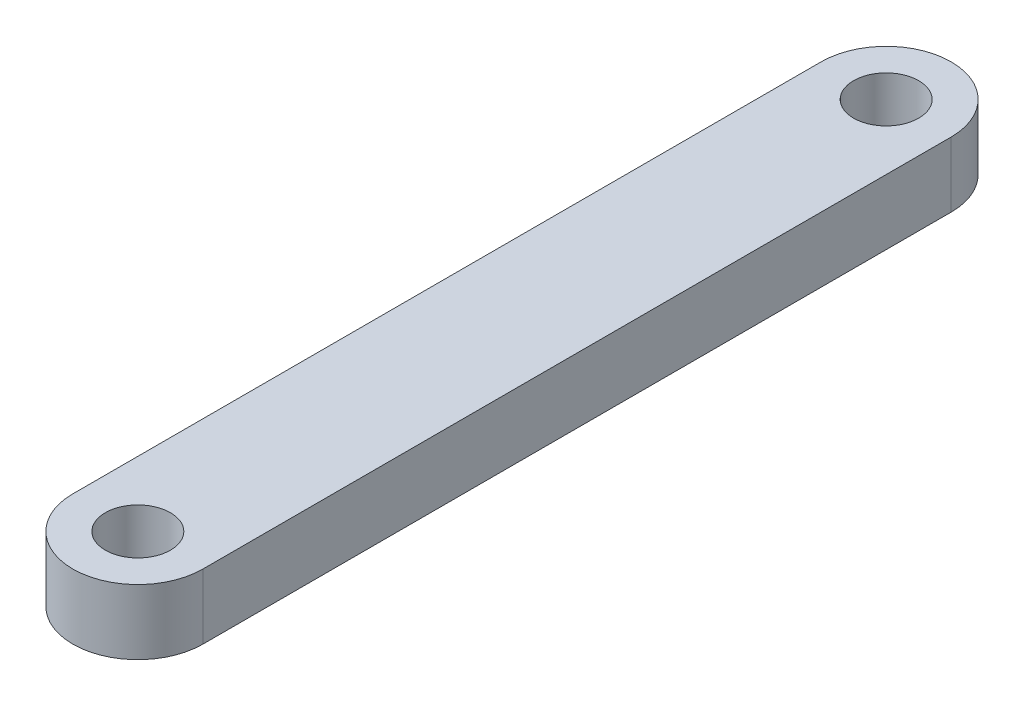
ISO-10303-21;
HEADER;
FILE_DESCRIPTION(('STEP AP214'),'2;1');
FILE_NAME('part.step','',(''),(''),'','','');
FILE_SCHEMA(('AUTOMOTIVE_DESIGN { 1 0 10303 214 1 1 1 1 }'));
ENDSEC;
DATA;
#1=APPLICATION_CONTEXT('core data for automotive mechanical design processes');
#2=APPLICATION_PROTOCOL_DEFINITION('international standard','automotive_design',2000,#1);
#3=PRODUCT_CONTEXT('',#1,'mechanical');
#4=PRODUCT('Part','Part','',(#3));
#5=PRODUCT_RELATED_PRODUCT_CATEGORY('part','',(#4));
#6=PRODUCT_DEFINITION_FORMATION('','',#4);
#7=PRODUCT_DEFINITION_CONTEXT('part definition',#1,'design');
#8=PRODUCT_DEFINITION('design','',#6,#7);
#9=PRODUCT_DEFINITION_SHAPE('','',#8);
#10=(LENGTH_UNIT() NAMED_UNIT(*) SI_UNIT(.MILLI.,.METRE.));
#11=(NAMED_UNIT(*) PLANE_ANGLE_UNIT() SI_UNIT($,.RADIAN.));
#12=(NAMED_UNIT(*) SI_UNIT($,.STERADIAN.) SOLID_ANGLE_UNIT());
#13=UNCERTAINTY_MEASURE_WITH_UNIT(LENGTH_MEASURE(1.E-05),#10,'distance_accuracy_value','');
#14=(GEOMETRIC_REPRESENTATION_CONTEXT(3) GLOBAL_UNCERTAINTY_ASSIGNED_CONTEXT((#13)) GLOBAL_UNIT_ASSIGNED_CONTEXT((#10,
#11,#12)) REPRESENTATION_CONTEXT('',''));
#15=CARTESIAN_POINT('',(0.,0.,0.));
#16=DIRECTION('',(0.,0.,1.));
#17=DIRECTION('',(1.,0.,0.));
#18=AXIS2_PLACEMENT_3D('',#15,#16,#17);
#19=CARTESIAN_POINT('',(0.,4.,-23.));
#20=DIRECTION('',(0.,1.,0.));
#21=DIRECTION('',(0.,0.,1.));
#22=AXIS2_PLACEMENT_3D('',#19,#20,#21);
#23=PLANE('',#22);
#24=CARTESIAN_POINT('',(0.,4.,-23.));
#25=DIRECTION('',(0.,1.,0.));
#26=DIRECTION('',(0.,0.,1.));
#27=AXIS2_PLACEMENT_3D('',#24,#25,#26);
#28=CIRCLE('',#27,2.);
#29=CARTESIAN_POINT('',(0.,4.,-21.));
#30=VERTEX_POINT('',#29);
#31=EDGE_CURVE('E116',#30,#30,#28,.T.);
#32=ORIENTED_EDGE('',*,*,#31,.F.);
#33=EDGE_LOOP('',(#32));
#34=FACE_BOUND('',#33,.T.);
#35=CARTESIAN_POINT('',(0.,4.,-23.));
#36=DIRECTION('',(0.,1.,0.));
#37=DIRECTION('',(0.,0.,1.));
#38=AXIS2_PLACEMENT_3D('',#35,#36,#37);
#39=CIRCLE('',#38,4.);
#40=CARTESIAN_POINT('',(3.99999999999999,4.,-23.));
#41=VERTEX_POINT('',#40);
#42=CARTESIAN_POINT('',(-4.00000000000001,4.,-23.));
#43=VERTEX_POINT('',#42);
#44=EDGE_CURVE('E96',#41,#43,#39,.T.);
#45=ORIENTED_EDGE('',*,*,#44,.T.);
#46=DIRECTION('',(0.,0.,1.));
#47=VECTOR('',#46,1.);
#48=CARTESIAN_POINT('',(-4.00000000000001,4.,-23.));
#49=LINE('',#48,#47);
#50=CARTESIAN_POINT('',(-3.99999999999999,4.,23.));
#51=VERTEX_POINT('',#50);
#52=EDGE_CURVE('E91',#43,#51,#49,.T.);
#53=ORIENTED_EDGE('',*,*,#52,.T.);
#54=CARTESIAN_POINT('',(0.,4.,23.));
#55=DIRECTION('',(0.,1.,0.));
#56=DIRECTION('',(0.,0.,1.));
#57=AXIS2_PLACEMENT_3D('',#54,#55,#56);
#58=CIRCLE('',#57,4.);
#59=CARTESIAN_POINT('',(4.,4.,23.));
#60=VERTEX_POINT('',#59);
#61=EDGE_CURVE('E94',#51,#60,#58,.T.);
#62=ORIENTED_EDGE('',*,*,#61,.T.);
#63=DIRECTION('',(0.,0.,-1.));
#64=VECTOR('',#63,1.);
#65=CARTESIAN_POINT('',(3.99999999999999,4.,-23.));
#66=LINE('',#65,#64);
#67=EDGE_CURVE('E61',#60,#41,#66,.T.);
#68=ORIENTED_EDGE('',*,*,#67,.T.);
#69=EDGE_LOOP('',(#45,#53,#62,#68));
#70=FACE_BOUND('',#69,.T.);
#71=CARTESIAN_POINT('',(0.,4.,23.));
#72=DIRECTION('',(0.,1.,0.));
#73=DIRECTION('',(0.,0.,1.));
#74=AXIS2_PLACEMENT_3D('',#71,#72,#73);
#75=CIRCLE('',#74,2.);
#76=CARTESIAN_POINT('',(0.,4.,25.));
#77=VERTEX_POINT('',#76);
#78=EDGE_CURVE('E138',#77,#77,#75,.T.);
#79=ORIENTED_EDGE('',*,*,#78,.F.);
#80=EDGE_LOOP('',(#79));
#81=FACE_BOUND('',#80,.T.);
#82=ADVANCED_FACE('F43',(#34,#70,#81),#23,.T.);
#83=CARTESIAN_POINT('',(0.,0.,-23.));
#84=DIRECTION('',(0.,1.,0.));
#85=DIRECTION('',(0.,0.,1.));
#86=AXIS2_PLACEMENT_3D('',#83,#84,#85);
#87=PLANE('',#86);
#88=CARTESIAN_POINT('',(0.,0.,-23.));
#89=DIRECTION('',(0.,1.,0.));
#90=DIRECTION('',(0.,0.,1.));
#91=AXIS2_PLACEMENT_3D('',#88,#89,#90);
#92=CIRCLE('',#91,4.);
#93=CARTESIAN_POINT('',(3.99999999999999,0.,-23.));
#94=VERTEX_POINT('',#93);
#95=CARTESIAN_POINT('',(-4.00000000000001,0.,-23.));
#96=VERTEX_POINT('',#95);
#97=EDGE_CURVE('E112',#94,#96,#92,.T.);
#98=ORIENTED_EDGE('',*,*,#97,.F.);
#99=DIRECTION('',(0.,0.,-1.));
#100=VECTOR('',#99,1.);
#101=CARTESIAN_POINT('',(3.99999999999999,0.,-23.));
#102=LINE('',#101,#100);
#103=CARTESIAN_POINT('',(4.,0.,23.));
#104=VERTEX_POINT('',#103);
#105=EDGE_CURVE('E84',#104,#94,#102,.T.);
#106=ORIENTED_EDGE('',*,*,#105,.F.);
#107=CARTESIAN_POINT('',(0.,0.,23.));
#108=DIRECTION('',(0.,1.,0.));
#109=DIRECTION('',(0.,0.,1.));
#110=AXIS2_PLACEMENT_3D('',#107,#108,#109);
#111=CIRCLE('',#110,4.);
#112=CARTESIAN_POINT('',(-3.99999999999999,0.,23.));
#113=VERTEX_POINT('',#112);
#114=EDGE_CURVE('E78',#113,#104,#111,.T.);
#115=ORIENTED_EDGE('',*,*,#114,.F.);
#116=DIRECTION('',(0.,0.,1.));
#117=VECTOR('',#116,1.);
#118=CARTESIAN_POINT('',(-4.00000000000001,0.,-23.));
#119=LINE('',#118,#117);
#120=EDGE_CURVE('E101',#96,#113,#119,.T.);
#121=ORIENTED_EDGE('',*,*,#120,.F.);
#122=EDGE_LOOP('',(#98,#106,#115,#121));
#123=FACE_BOUND('',#122,.T.);
#124=CARTESIAN_POINT('',(0.,0.,-23.));
#125=DIRECTION('',(0.,1.,0.));
#126=DIRECTION('',(0.,0.,1.));
#127=AXIS2_PLACEMENT_3D('',#124,#125,#126);
#128=CIRCLE('',#127,2.);
#129=CARTESIAN_POINT('',(0.,0.,-21.));
#130=VERTEX_POINT('',#129);
#131=EDGE_CURVE('E134',#130,#130,#128,.T.);
#132=ORIENTED_EDGE('',*,*,#131,.T.);
#133=EDGE_LOOP('',(#132));
#134=FACE_BOUND('',#133,.T.);
#135=CARTESIAN_POINT('',(0.,0.,23.));
#136=DIRECTION('',(0.,1.,0.));
#137=DIRECTION('',(0.,0.,1.));
#138=AXIS2_PLACEMENT_3D('',#135,#136,#137);
#139=CIRCLE('',#138,2.);
#140=CARTESIAN_POINT('',(0.,0.,25.));
#141=VERTEX_POINT('',#140);
#142=EDGE_CURVE('E142',#141,#141,#139,.T.);
#143=ORIENTED_EDGE('',*,*,#142,.T.);
#144=EDGE_LOOP('',(#143));
#145=FACE_BOUND('',#144,.T.);
#146=ADVANCED_FACE('F129',(#123,#134,#145),#87,.F.);
#147=CARTESIAN_POINT('',(0.,4.,-23.));
#148=DIRECTION('',(0.,-1.,0.));
#149=DIRECTION('',(0.,0.,-1.));
#150=AXIS2_PLACEMENT_3D('',#147,#148,#149);
#151=CYLINDRICAL_SURFACE('',#150,4.);
#152=ORIENTED_EDGE('',*,*,#97,.T.);
#153=DIRECTION('',(0.,-1.,0.));
#154=VECTOR('',#153,1.);
#155=CARTESIAN_POINT('',(-4.00000000000001,4.,-23.));
#156=LINE('',#155,#154);
#157=EDGE_CURVE('E11',#43,#96,#156,.T.);
#158=ORIENTED_EDGE('',*,*,#157,.F.);
#159=ORIENTED_EDGE('',*,*,#44,.F.);
#160=DIRECTION('',(0.,-1.,0.));
#161=VECTOR('',#160,1.);
#162=CARTESIAN_POINT('',(3.99999999999999,4.,-23.));
#163=LINE('',#162,#161);
#164=EDGE_CURVE('E108',#41,#94,#163,.T.);
#165=ORIENTED_EDGE('',*,*,#164,.T.);
#166=EDGE_LOOP('',(#152,#158,#159,#165));
#167=FACE_BOUND('',#166,.T.);
#168=ADVANCED_FACE('F45',(#167),#151,.T.);
#169=CARTESIAN_POINT('',(-4.00000000000001,4.,-23.));
#170=DIRECTION('',(1.,0.,0.));
#171=DIRECTION('',(0.,0.,-1.));
#172=AXIS2_PLACEMENT_3D('',#169,#170,#171);
#173=PLANE('',#172);
#174=ORIENTED_EDGE('',*,*,#120,.T.);
#175=DIRECTION('',(0.,-1.,0.));
#176=VECTOR('',#175,1.);
#177=CARTESIAN_POINT('',(-3.99999999999999,4.,23.));
#178=LINE('',#177,#176);
#179=EDGE_CURVE('E53',#51,#113,#178,.T.);
#180=ORIENTED_EDGE('',*,*,#179,.F.);
#181=ORIENTED_EDGE('',*,*,#52,.F.);
#182=ORIENTED_EDGE('',*,*,#157,.T.);
#183=EDGE_LOOP('',(#174,#180,#181,#182));
#184=FACE_BOUND('',#183,.T.);
#185=ADVANCED_FACE('F100',(#184),#173,.F.);
#186=CARTESIAN_POINT('',(0.,4.,23.));
#187=DIRECTION('',(0.,-1.,0.));
#188=DIRECTION('',(0.,0.,-1.));
#189=AXIS2_PLACEMENT_3D('',#186,#187,#188);
#190=CYLINDRICAL_SURFACE('',#189,4.);
#191=ORIENTED_EDGE('',*,*,#114,.T.);
#192=DIRECTION('',(0.,-1.,0.));
#193=VECTOR('',#192,1.);
#194=CARTESIAN_POINT('',(4.,4.,23.));
#195=LINE('',#194,#193);
#196=EDGE_CURVE('E103',#60,#104,#195,.T.);
#197=ORIENTED_EDGE('',*,*,#196,.F.);
#198=ORIENTED_EDGE('',*,*,#61,.F.);
#199=ORIENTED_EDGE('',*,*,#179,.T.);
#200=EDGE_LOOP('',(#191,#197,#198,#199));
#201=FACE_BOUND('',#200,.T.);
#202=ADVANCED_FACE('F104',(#201),#190,.T.);
#203=CARTESIAN_POINT('',(3.99999999999999,4.,-23.));
#204=DIRECTION('',(-1.,0.,0.));
#205=DIRECTION('',(0.,0.,1.));
#206=AXIS2_PLACEMENT_3D('',#203,#204,#205);
#207=PLANE('',#206);
#208=ORIENTED_EDGE('',*,*,#105,.T.);
#209=ORIENTED_EDGE('',*,*,#164,.F.);
#210=ORIENTED_EDGE('',*,*,#67,.F.);
#211=ORIENTED_EDGE('',*,*,#196,.T.);
#212=EDGE_LOOP('',(#208,#209,#210,#211));
#213=FACE_BOUND('',#212,.T.);
#214=ADVANCED_FACE('F126',(#213),#207,.F.);
#215=CARTESIAN_POINT('',(0.,4.,-23.));
#216=DIRECTION('',(0.,-1.,0.));
#217=DIRECTION('',(0.,0.,-1.));
#218=AXIS2_PLACEMENT_3D('',#215,#216,#217);
#219=CYLINDRICAL_SURFACE('',#218,2.);
#220=ORIENTED_EDGE('',*,*,#31,.T.);
#221=EDGE_LOOP('',(#220));
#222=FACE_BOUND('',#221,.T.);
#223=ORIENTED_EDGE('',*,*,#131,.F.);
#224=EDGE_LOOP('',(#223));
#225=FACE_BOUND('',#224,.T.);
#226=ADVANCED_FACE('F161',(#222,#225),#219,.F.);
#227=CARTESIAN_POINT('',(0.,4.,23.));
#228=DIRECTION('',(0.,-1.,0.));
#229=DIRECTION('',(0.,0.,-1.));
#230=AXIS2_PLACEMENT_3D('',#227,#228,#229);
#231=CYLINDRICAL_SURFACE('',#230,2.);
#232=ORIENTED_EDGE('',*,*,#78,.T.);
#233=EDGE_LOOP('',(#232));
#234=FACE_BOUND('',#233,.T.);
#235=ORIENTED_EDGE('',*,*,#142,.F.);
#236=EDGE_LOOP('',(#235));
#237=FACE_BOUND('',#236,.T.);
#238=ADVANCED_FACE('F150',(#234,#237),#231,.F.);
#239=CLOSED_SHELL('',(#82,#146,#168,#185,#202,#214,#226,#238));
#240=MANIFOLD_SOLID_BREP('B2',#239);
#241=ADVANCED_BREP_SHAPE_REPRESENTATION('',(#18,#240),#14);
#242=SHAPE_DEFINITION_REPRESENTATION(#9,#241);
ENDSEC;
END-ISO-10303-21;
